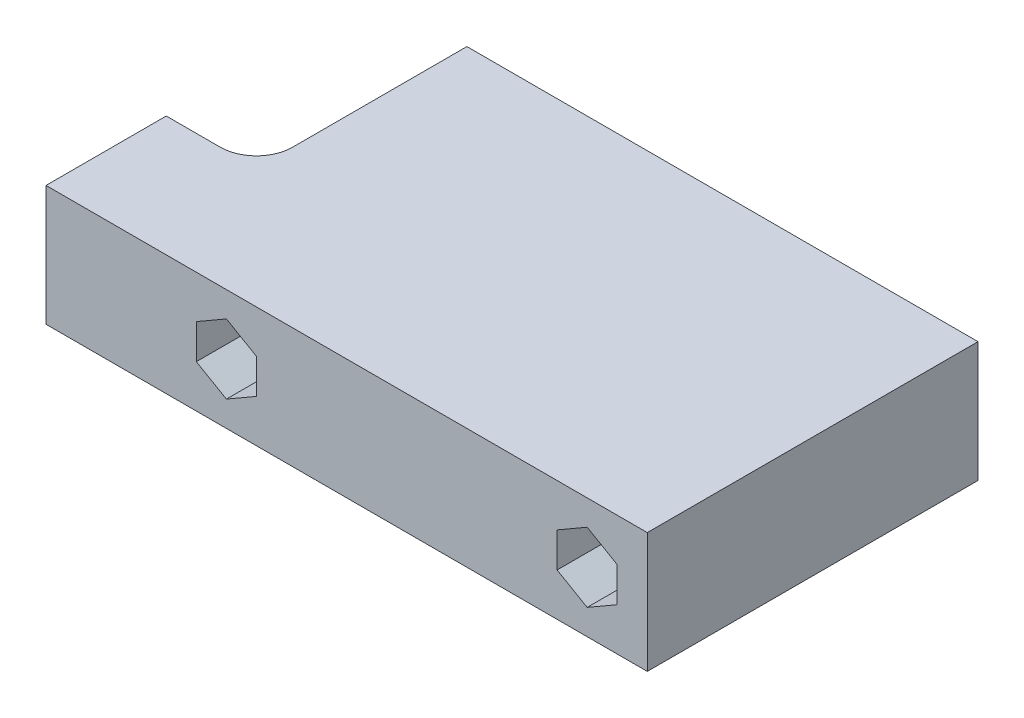
ISO-10303-21;
HEADER;
FILE_DESCRIPTION(('STEP AP214'),'2;1');
FILE_NAME('part.step','',(''),(''),'','','');
FILE_SCHEMA(('AUTOMOTIVE_DESIGN { 1 0 10303 214 1 1 1 1 }'));
ENDSEC;
DATA;
#1=APPLICATION_CONTEXT('core data for automotive mechanical design processes');
#2=APPLICATION_PROTOCOL_DEFINITION('international standard','automotive_design',2000,#1);
#3=PRODUCT_CONTEXT('',#1,'mechanical');
#4=PRODUCT('Part','Part','',(#3));
#5=PRODUCT_RELATED_PRODUCT_CATEGORY('part','',(#4));
#6=PRODUCT_DEFINITION_FORMATION('','',#4);
#7=PRODUCT_DEFINITION_CONTEXT('part definition',#1,'design');
#8=PRODUCT_DEFINITION('design','',#6,#7);
#9=PRODUCT_DEFINITION_SHAPE('','',#8);
#10=(LENGTH_UNIT() NAMED_UNIT(*) SI_UNIT(.MILLI.,.METRE.));
#11=(NAMED_UNIT(*) PLANE_ANGLE_UNIT() SI_UNIT($,.RADIAN.));
#12=(NAMED_UNIT(*) SI_UNIT($,.STERADIAN.) SOLID_ANGLE_UNIT());
#13=UNCERTAINTY_MEASURE_WITH_UNIT(LENGTH_MEASURE(1.E-05),#10,'distance_accuracy_value','');
#14=(GEOMETRIC_REPRESENTATION_CONTEXT(3) GLOBAL_UNCERTAINTY_ASSIGNED_CONTEXT((#13)) GLOBAL_UNIT_ASSIGNED_CONTEXT((#10,
#11,#12)) REPRESENTATION_CONTEXT('',''));
#15=CARTESIAN_POINT('',(0.,0.,0.));
#16=DIRECTION('',(0.,0.,1.));
#17=DIRECTION('',(1.,0.,0.));
#18=AXIS2_PLACEMENT_3D('',#15,#16,#17);
#19=CARTESIAN_POINT('',(-50.,0.,0.));
#20=DIRECTION('',(1.,0.,0.));
#21=DIRECTION('',(0.,0.,-1.));
#22=AXIS2_PLACEMENT_3D('',#19,#20,#21);
#23=PLANE('',#22);
#24=DIRECTION('',(0.,0.500000000000001,0.866025403784438));
#25=VECTOR('',#24,1.);
#26=CARTESIAN_POINT('',(-50.,2.40192378864668,-4.99999999999999));
#27=LINE('',#26,#25);
#28=CARTESIAN_POINT('',(-50.,2.40192378864668,-4.99999999999999));
#29=VERTEX_POINT('',#28);
#30=CARTESIAN_POINT('',(-50.,3.70096189432335,-2.74999999999999));
#31=VERTEX_POINT('',#30);
#32=EDGE_CURVE('E233',#29,#31,#27,.T.);
#33=ORIENTED_EDGE('',*,*,#32,.F.);
#34=DIRECTION('',(0.,-0.5,0.866025403784439));
#35=VECTOR('',#34,1.);
#36=CARTESIAN_POINT('',(-50.,3.70096189432334,-7.24999999999999));
#37=LINE('',#36,#35);
#38=CARTESIAN_POINT('',(-50.,3.70096189432334,-7.24999999999999));
#39=VERTEX_POINT('',#38);
#40=EDGE_CURVE('E47',#39,#29,#37,.T.);
#41=ORIENTED_EDGE('',*,*,#40,.F.);
#42=DIRECTION('',(0.,-1.,0.));
#43=VECTOR('',#42,1.);
#44=CARTESIAN_POINT('',(-50.,6.29903810567666,-7.24999999999999));
#45=LINE('',#44,#43);
#46=CARTESIAN_POINT('',(-50.,6.29903810567666,-7.24999999999999));
#47=VERTEX_POINT('',#46);
#48=EDGE_CURVE('E219',#47,#39,#45,.T.);
#49=ORIENTED_EDGE('',*,*,#48,.F.);
#50=DIRECTION('',(0.,-0.500000000000001,-0.866025403784438));
#51=VECTOR('',#50,1.);
#52=CARTESIAN_POINT('',(-50.,7.59807621135332,-4.99999999999999));
#53=LINE('',#52,#51);
#54=CARTESIAN_POINT('',(-50.,7.59807621135332,-4.99999999999999));
#55=VERTEX_POINT('',#54);
#56=EDGE_CURVE('E222',#55,#47,#53,.T.);
#57=ORIENTED_EDGE('',*,*,#56,.F.);
#58=DIRECTION('',(0.,0.5,-0.866025403784439));
#59=VECTOR('',#58,1.);
#60=CARTESIAN_POINT('',(-50.,6.29903810567666,-2.74999999999999));
#61=LINE('',#60,#59);
#62=CARTESIAN_POINT('',(-50.,6.29903810567666,-2.74999999999999));
#63=VERTEX_POINT('',#62);
#64=EDGE_CURVE('E238',#63,#55,#61,.T.);
#65=ORIENTED_EDGE('',*,*,#64,.F.);
#66=DIRECTION('',(0.,1.,0.));
#67=VECTOR('',#66,1.);
#68=CARTESIAN_POINT('',(-50.,3.70096189432335,-2.74999999999999));
#69=LINE('',#68,#67);
#70=EDGE_CURVE('E235',#31,#63,#69,.T.);
#71=ORIENTED_EDGE('',*,*,#70,.F.);
#72=EDGE_LOOP('',(#33,#41,#49,#57,#65,#71));
#73=FACE_BOUND('',#72,.T.);
#74=DIRECTION('',(0.,0.,-1.));
#75=VECTOR('',#74,1.);
#76=CARTESIAN_POINT('',(-50.,10.,0.));
#77=LINE('',#76,#75);
#78=CARTESIAN_POINT('',(-50.,10.,0.));
#79=VERTEX_POINT('',#78);
#80=CARTESIAN_POINT('',(-50.,10.,-9.99999999999999));
#81=VERTEX_POINT('',#80);
#82=EDGE_CURVE('E11',#79,#81,#77,.T.);
#83=ORIENTED_EDGE('',*,*,#82,.T.);
#84=DIRECTION('',(0.,1.,0.));
#85=VECTOR('',#84,1.);
#86=CARTESIAN_POINT('',(-50.,0.,-9.99999999999999));
#87=LINE('',#86,#85);
#88=CARTESIAN_POINT('',(-50.,0.,-9.99999999999999));
#89=VERTEX_POINT('',#88);
#90=EDGE_CURVE('E392',#89,#81,#87,.T.);
#91=ORIENTED_EDGE('',*,*,#90,.F.);
#92=DIRECTION('',(0.,0.,-1.));
#93=VECTOR('',#92,1.);
#94=CARTESIAN_POINT('',(-50.,0.,0.));
#95=LINE('',#94,#93);
#96=CARTESIAN_POINT('',(-50.,0.,0.));
#97=VERTEX_POINT('',#96);
#98=EDGE_CURVE('E394',#97,#89,#95,.T.);
#99=ORIENTED_EDGE('',*,*,#98,.F.);
#100=DIRECTION('',(0.,-1.,0.));
#101=VECTOR('',#100,1.);
#102=CARTESIAN_POINT('',(-50.,10.,0.));
#103=LINE('',#102,#101);
#104=EDGE_CURVE('E36',#79,#97,#103,.T.);
#105=ORIENTED_EDGE('',*,*,#104,.F.);
#106=EDGE_LOOP('',(#83,#91,#99,#105));
#107=FACE_BOUND('',#106,.T.);
#108=ADVANCED_FACE('F33',(#73,#107),#23,.F.);
#109=CARTESIAN_POINT('',(-2.5,6.44337567297407,-27.5));
#110=DIRECTION('',(0.500000000000001,0.866025403784438,0.));
#111=DIRECTION('',(-0.866025403784438,0.500000000000001,0.));
#112=AXIS2_PLACEMENT_3D('',#109,#110,#111);
#113=PLANE('',#112);
#114=DIRECTION('',(-0.866025403784438,0.500000000000001,0.));
#115=VECTOR('',#114,1.);
#116=CARTESIAN_POINT('',(-2.5,6.44337567297407,0.));
#117=LINE('',#116,#115);
#118=CARTESIAN_POINT('',(-2.5,6.44337567297407,0.));
#119=VERTEX_POINT('',#118);
#120=CARTESIAN_POINT('',(-5.,7.88675134594813,0.));
#121=VERTEX_POINT('',#120);
#122=EDGE_CURVE('E338',#119,#121,#117,.T.);
#123=ORIENTED_EDGE('',*,*,#122,.T.);
#124=DIRECTION('',(0.,0.,1.));
#125=VECTOR('',#124,1.);
#126=CARTESIAN_POINT('',(-5.,7.88675134594813,-27.5));
#127=LINE('',#126,#125);
#128=CARTESIAN_POINT('',(-5.,7.88675134594813,-27.5));
#129=VERTEX_POINT('',#128);
#130=EDGE_CURVE('E354',#129,#121,#127,.T.);
#131=ORIENTED_EDGE('',*,*,#130,.F.);
#132=DIRECTION('',(-0.866025403784438,0.500000000000001,0.));
#133=VECTOR('',#132,1.);
#134=CARTESIAN_POINT('',(-2.5,6.44337567297407,-27.5));
#135=LINE('',#134,#133);
#136=CARTESIAN_POINT('',(-2.5,6.44337567297406,-27.5));
#137=VERTEX_POINT('',#136);
#138=EDGE_CURVE('E321',#137,#129,#135,.T.);
#139=ORIENTED_EDGE('',*,*,#138,.F.);
#140=DIRECTION('',(0.,0.,1.));
#141=VECTOR('',#140,1.);
#142=CARTESIAN_POINT('',(-2.5,6.44337567297407,-27.5));
#143=LINE('',#142,#141);
#144=EDGE_CURVE('E356',#137,#119,#143,.T.);
#145=ORIENTED_EDGE('',*,*,#144,.T.);
#146=EDGE_LOOP('',(#123,#131,#139,#145));
#147=FACE_BOUND('',#146,.T.);
#148=ADVANCED_FACE('F434',(#147),#113,.F.);
#149=CARTESIAN_POINT('',(-5.,7.88675134594813,-27.5));
#150=DIRECTION('',(-0.5,0.866025403784439,0.));
#151=DIRECTION('',(-0.866025403784438,-0.5,0.));
#152=AXIS2_PLACEMENT_3D('',#149,#150,#151);
#153=PLANE('',#152);
#154=DIRECTION('',(-0.866025403784439,-0.5,0.));
#155=VECTOR('',#154,1.);
#156=CARTESIAN_POINT('',(-5.,7.88675134594813,0.));
#157=LINE('',#156,#155);
#158=CARTESIAN_POINT('',(-7.5,6.44337567297407,0.));
#159=VERTEX_POINT('',#158);
#160=EDGE_CURVE('E341',#121,#159,#157,.T.);
#161=ORIENTED_EDGE('',*,*,#160,.T.);
#162=DIRECTION('',(0.,0.,1.));
#163=VECTOR('',#162,1.);
#164=CARTESIAN_POINT('',(-7.5,6.44337567297407,-27.5));
#165=LINE('',#164,#163);
#166=CARTESIAN_POINT('',(-7.5,6.44337567297407,-27.5));
#167=VERTEX_POINT('',#166);
#168=EDGE_CURVE('E352',#167,#159,#165,.T.);
#169=ORIENTED_EDGE('',*,*,#168,.F.);
#170=DIRECTION('',(-0.866025403784439,-0.5,0.));
#171=VECTOR('',#170,1.);
#172=CARTESIAN_POINT('',(-5.,7.88675134594813,-27.5));
#173=LINE('',#172,#171);
#174=EDGE_CURVE('E324',#129,#167,#173,.T.);
#175=ORIENTED_EDGE('',*,*,#174,.F.);
#176=ORIENTED_EDGE('',*,*,#130,.T.);
#177=EDGE_LOOP('',(#161,#169,#175,#176));
#178=FACE_BOUND('',#177,.T.);
#179=ADVANCED_FACE('F441',(#178),#153,.F.);
#180=CARTESIAN_POINT('',(-7.5,6.44337567297407,-27.5));
#181=DIRECTION('',(-1.,0.,0.));
#182=DIRECTION('',(0.,-1.,0.));
#183=AXIS2_PLACEMENT_3D('',#180,#181,#182);
#184=PLANE('',#183);
#185=DIRECTION('',(0.,-1.,0.));
#186=VECTOR('',#185,1.);
#187=CARTESIAN_POINT('',(-7.5,6.44337567297407,0.));
#188=LINE('',#187,#186);
#189=CARTESIAN_POINT('',(-7.5,3.55662432702594,0.));
#190=VERTEX_POINT('',#189);
#191=EDGE_CURVE('E344',#159,#190,#188,.T.);
#192=ORIENTED_EDGE('',*,*,#191,.T.);
#193=DIRECTION('',(0.,0.,1.));
#194=VECTOR('',#193,1.);
#195=CARTESIAN_POINT('',(-7.5,3.55662432702594,-27.5));
#196=LINE('',#195,#194);
#197=CARTESIAN_POINT('',(-7.5,3.55662432702594,-27.5));
#198=VERTEX_POINT('',#197);
#199=EDGE_CURVE('E350',#198,#190,#196,.T.);
#200=ORIENTED_EDGE('',*,*,#199,.F.);
#201=DIRECTION('',(0.,-1.,0.));
#202=VECTOR('',#201,1.);
#203=CARTESIAN_POINT('',(-7.5,6.44337567297407,-27.5));
#204=LINE('',#203,#202);
#205=EDGE_CURVE('E327',#167,#198,#204,.T.);
#206=ORIENTED_EDGE('',*,*,#205,.F.);
#207=ORIENTED_EDGE('',*,*,#168,.T.);
#208=EDGE_LOOP('',(#192,#200,#206,#207));
#209=FACE_BOUND('',#208,.T.);
#210=ADVANCED_FACE('F483',(#209),#184,.F.);
#211=CARTESIAN_POINT('',(-7.5,3.55662432702594,-27.5));
#212=DIRECTION('',(-0.500000000000001,-0.866025403784438,0.));
#213=DIRECTION('',(0.866025403784438,-0.500000000000001,0.));
#214=AXIS2_PLACEMENT_3D('',#211,#212,#213);
#215=PLANE('',#214);
#216=DIRECTION('',(0.866025403784438,-0.500000000000001,0.));
#217=VECTOR('',#216,1.);
#218=CARTESIAN_POINT('',(-7.5,3.55662432702594,0.));
#219=LINE('',#218,#217);
#220=CARTESIAN_POINT('',(-5.,2.11324865405187,0.));
#221=VERTEX_POINT('',#220);
#222=EDGE_CURVE('E318',#190,#221,#219,.T.);
#223=ORIENTED_EDGE('',*,*,#222,.T.);
#224=DIRECTION('',(0.,0.,1.));
#225=VECTOR('',#224,1.);
#226=CARTESIAN_POINT('',(-5.,2.11324865405187,-27.5));
#227=LINE('',#226,#225);
#228=CARTESIAN_POINT('',(-5.,2.11324865405187,-27.5));
#229=VERTEX_POINT('',#228);
#230=EDGE_CURVE('E287',#229,#221,#227,.T.);
#231=ORIENTED_EDGE('',*,*,#230,.F.);
#232=DIRECTION('',(0.866025403784438,-0.500000000000001,0.));
#233=VECTOR('',#232,1.);
#234=CARTESIAN_POINT('',(-7.5,3.55662432702594,-27.5));
#235=LINE('',#234,#233);
#236=EDGE_CURVE('E330',#198,#229,#235,.T.);
#237=ORIENTED_EDGE('',*,*,#236,.F.);
#238=ORIENTED_EDGE('',*,*,#199,.T.);
#239=EDGE_LOOP('',(#223,#231,#237,#238));
#240=FACE_BOUND('',#239,.T.);
#241=ADVANCED_FACE('F479',(#240),#215,.F.);
#242=CARTESIAN_POINT('',(-5.,2.11324865405187,-27.5));
#243=DIRECTION('',(0.5,-0.866025403784439,0.));
#244=DIRECTION('',(0.866025403784439,0.5,0.));
#245=AXIS2_PLACEMENT_3D('',#242,#243,#244);
#246=PLANE('',#245);
#247=DIRECTION('',(0.866025403784439,0.5,0.));
#248=VECTOR('',#247,1.);
#249=CARTESIAN_POINT('',(-5.,2.11324865405187,0.));
#250=LINE('',#249,#248);
#251=CARTESIAN_POINT('',(-2.5,3.55662432702594,0.));
#252=VERTEX_POINT('',#251);
#253=EDGE_CURVE('E263',#221,#252,#250,.T.);
#254=ORIENTED_EDGE('',*,*,#253,.T.);
#255=DIRECTION('',(0.,0.,1.));
#256=VECTOR('',#255,1.);
#257=CARTESIAN_POINT('',(-2.5,3.55662432702594,-27.5));
#258=LINE('',#257,#256);
#259=CARTESIAN_POINT('',(-2.5,3.55662432702594,-27.5));
#260=VERTEX_POINT('',#259);
#261=EDGE_CURVE('E333',#260,#252,#258,.T.);
#262=ORIENTED_EDGE('',*,*,#261,.F.);
#263=DIRECTION('',(0.866025403784439,0.5,0.));
#264=VECTOR('',#263,1.);
#265=CARTESIAN_POINT('',(-5.,2.11324865405187,-27.5));
#266=LINE('',#265,#264);
#267=EDGE_CURVE('E314',#229,#260,#266,.T.);
#268=ORIENTED_EDGE('',*,*,#267,.F.);
#269=ORIENTED_EDGE('',*,*,#230,.T.);
#270=EDGE_LOOP('',(#254,#262,#268,#269));
#271=FACE_BOUND('',#270,.T.);
#272=ADVANCED_FACE('F482',(#271),#246,.F.);
#273=CARTESIAN_POINT('',(-2.5,3.55662432702594,-27.5));
#274=DIRECTION('',(1.,0.,0.));
#275=DIRECTION('',(0.,1.,0.));
#276=AXIS2_PLACEMENT_3D('',#273,#274,#275);
#277=PLANE('',#276);
#278=DIRECTION('',(0.,1.,0.));
#279=VECTOR('',#278,1.);
#280=CARTESIAN_POINT('',(-2.5,3.55662432702594,0.));
#281=LINE('',#280,#279);
#282=EDGE_CURVE('E335',#252,#119,#281,.T.);
#283=ORIENTED_EDGE('',*,*,#282,.T.);
#284=ORIENTED_EDGE('',*,*,#144,.F.);
#285=DIRECTION('',(0.,1.,0.));
#286=VECTOR('',#285,1.);
#287=CARTESIAN_POINT('',(-2.5,3.55662432702594,-27.5));
#288=LINE('',#287,#286);
#289=EDGE_CURVE('E317',#260,#137,#288,.T.);
#290=ORIENTED_EDGE('',*,*,#289,.F.);
#291=ORIENTED_EDGE('',*,*,#261,.T.);
#292=EDGE_LOOP('',(#283,#284,#290,#291));
#293=FACE_BOUND('',#292,.T.);
#294=ADVANCED_FACE('F470',(#293),#277,.F.);
#295=CARTESIAN_POINT('',(-32.5,6.44337567297407,-27.5));
#296=DIRECTION('',(0.500000000000001,0.866025403784438,0.));
#297=DIRECTION('',(-0.866025403784438,0.500000000000001,0.));
#298=AXIS2_PLACEMENT_3D('',#295,#296,#297);
#299=PLANE('',#298);
#300=DIRECTION('',(-0.866025403784438,0.500000000000001,0.));
#301=VECTOR('',#300,1.);
#302=CARTESIAN_POINT('',(-32.5,6.44337567297407,0.));
#303=LINE('',#302,#301);
#304=CARTESIAN_POINT('',(-32.5,6.44337567297407,0.));
#305=VERTEX_POINT('',#304);
#306=CARTESIAN_POINT('',(-35.,7.88675134594814,0.));
#307=VERTEX_POINT('',#306);
#308=EDGE_CURVE('E290',#305,#307,#303,.T.);
#309=ORIENTED_EDGE('',*,*,#308,.T.);
#310=DIRECTION('',(0.,0.,1.));
#311=VECTOR('',#310,1.);
#312=CARTESIAN_POINT('',(-35.,7.88675134594814,-27.5));
#313=LINE('',#312,#311);
#314=CARTESIAN_POINT('',(-35.,7.88675134594814,-27.5));
#315=VERTEX_POINT('',#314);
#316=EDGE_CURVE('E308',#315,#307,#313,.T.);
#317=ORIENTED_EDGE('',*,*,#316,.F.);
#318=DIRECTION('',(-0.866025403784438,0.500000000000001,0.));
#319=VECTOR('',#318,1.);
#320=CARTESIAN_POINT('',(-32.5,6.44337567297407,-27.5));
#321=LINE('',#320,#319);
#322=CARTESIAN_POINT('',(-32.5,6.44337567297407,-27.5));
#323=VERTEX_POINT('',#322);
#324=EDGE_CURVE('E271',#323,#315,#321,.T.);
#325=ORIENTED_EDGE('',*,*,#324,.F.);
#326=DIRECTION('',(0.,0.,1.));
#327=VECTOR('',#326,1.);
#328=CARTESIAN_POINT('',(-32.5,6.44337567297407,-27.5));
#329=LINE('',#328,#327);
#330=EDGE_CURVE('E310',#323,#305,#329,.T.);
#331=ORIENTED_EDGE('',*,*,#330,.T.);
#332=EDGE_LOOP('',(#309,#317,#325,#331));
#333=FACE_BOUND('',#332,.T.);
#334=ADVANCED_FACE('F466',(#333),#299,.F.);
#335=CARTESIAN_POINT('',(-35.,7.88675134594814,-27.5));
#336=DIRECTION('',(-0.5,0.866025403784439,0.));
#337=DIRECTION('',(-0.866025403784439,-0.5,0.));
#338=AXIS2_PLACEMENT_3D('',#335,#336,#337);
#339=PLANE('',#338);
#340=DIRECTION('',(-0.866025403784439,-0.5,0.));
#341=VECTOR('',#340,1.);
#342=CARTESIAN_POINT('',(-35.,7.88675134594814,0.));
#343=LINE('',#342,#341);
#344=CARTESIAN_POINT('',(-37.5,6.44337567297407,0.));
#345=VERTEX_POINT('',#344);
#346=EDGE_CURVE('E293',#307,#345,#343,.T.);
#347=ORIENTED_EDGE('',*,*,#346,.T.);
#348=DIRECTION('',(0.,0.,1.));
#349=VECTOR('',#348,1.);
#350=CARTESIAN_POINT('',(-37.5,6.44337567297407,-27.5));
#351=LINE('',#350,#349);
#352=CARTESIAN_POINT('',(-37.5,6.44337567297407,-27.5));
#353=VERTEX_POINT('',#352);
#354=EDGE_CURVE('E306',#353,#345,#351,.T.);
#355=ORIENTED_EDGE('',*,*,#354,.F.);
#356=DIRECTION('',(-0.866025403784439,-0.5,0.));
#357=VECTOR('',#356,1.);
#358=CARTESIAN_POINT('',(-35.,7.88675134594814,-27.5));
#359=LINE('',#358,#357);
#360=EDGE_CURVE('E274',#315,#353,#359,.T.);
#361=ORIENTED_EDGE('',*,*,#360,.F.);
#362=ORIENTED_EDGE('',*,*,#316,.T.);
#363=EDGE_LOOP('',(#347,#355,#361,#362));
#364=FACE_BOUND('',#363,.T.);
#365=ADVANCED_FACE('F462',(#364),#339,.F.);
#366=CARTESIAN_POINT('',(-37.5,6.44337567297407,-27.5));
#367=DIRECTION('',(-1.,0.,0.));
#368=DIRECTION('',(0.,0.,1.));
#369=AXIS2_PLACEMENT_3D('',#366,#367,#368);
#370=PLANE('',#369);
#371=DIRECTION('',(0.,-1.,0.));
#372=VECTOR('',#371,1.);
#373=CARTESIAN_POINT('',(-37.5,6.44337567297407,0.));
#374=LINE('',#373,#372);
#375=CARTESIAN_POINT('',(-37.5,3.55662432702594,0.));
#376=VERTEX_POINT('',#375);
#377=EDGE_CURVE('E296',#345,#376,#374,.T.);
#378=ORIENTED_EDGE('',*,*,#377,.T.);
#379=DIRECTION('',(0.,0.,1.));
#380=VECTOR('',#379,1.);
#381=CARTESIAN_POINT('',(-37.5,3.55662432702594,-27.5));
#382=LINE('',#381,#380);
#383=CARTESIAN_POINT('',(-37.5,3.55662432702594,-27.5));
#384=VERTEX_POINT('',#383);
#385=EDGE_CURVE('E304',#384,#376,#382,.T.);
#386=ORIENTED_EDGE('',*,*,#385,.F.);
#387=DIRECTION('',(0.,-1.,0.));
#388=VECTOR('',#387,1.);
#389=CARTESIAN_POINT('',(-37.5,6.44337567297407,-27.5));
#390=LINE('',#389,#388);
#391=EDGE_CURVE('E277',#353,#384,#390,.T.);
#392=ORIENTED_EDGE('',*,*,#391,.F.);
#393=ORIENTED_EDGE('',*,*,#354,.T.);
#394=EDGE_LOOP('',(#378,#386,#392,#393));
#395=FACE_BOUND('',#394,.T.);
#396=ADVANCED_FACE('F458',(#395),#370,.F.);
#397=CARTESIAN_POINT('',(-37.5,3.55662432702594,-27.5));
#398=DIRECTION('',(-0.5,-0.866025403784439,0.));
#399=DIRECTION('',(0.866025403784439,-0.5,0.));
#400=AXIS2_PLACEMENT_3D('',#397,#398,#399);
#401=PLANE('',#400);
#402=DIRECTION('',(0.866025403784439,-0.5,0.));
#403=VECTOR('',#402,1.);
#404=CARTESIAN_POINT('',(-37.5,3.55662432702594,0.));
#405=LINE('',#404,#403);
#406=CARTESIAN_POINT('',(-35.,2.11324865405187,0.));
#407=VERTEX_POINT('',#406);
#408=EDGE_CURVE('E268',#376,#407,#405,.T.);
#409=ORIENTED_EDGE('',*,*,#408,.T.);
#410=DIRECTION('',(0.,0.,1.));
#411=VECTOR('',#410,1.);
#412=CARTESIAN_POINT('',(-35.,2.11324865405187,-27.5));
#413=LINE('',#412,#411);
#414=CARTESIAN_POINT('',(-35.,2.11324865405187,-27.5));
#415=VERTEX_POINT('',#414);
#416=EDGE_CURVE('E301',#415,#407,#413,.T.);
#417=ORIENTED_EDGE('',*,*,#416,.F.);
#418=DIRECTION('',(0.866025403784439,-0.5,0.));
#419=VECTOR('',#418,1.);
#420=CARTESIAN_POINT('',(-37.5,3.55662432702594,-27.5));
#421=LINE('',#420,#419);
#422=EDGE_CURVE('E280',#384,#415,#421,.T.);
#423=ORIENTED_EDGE('',*,*,#422,.F.);
#424=ORIENTED_EDGE('',*,*,#385,.T.);
#425=EDGE_LOOP('',(#409,#417,#423,#424));
#426=FACE_BOUND('',#425,.T.);
#427=ADVANCED_FACE('F454',(#426),#401,.F.);
#428=CARTESIAN_POINT('',(-35.,2.11324865405187,-27.5));
#429=DIRECTION('',(0.5,-0.866025403784438,0.));
#430=DIRECTION('',(0.866025403784438,0.5,0.));
#431=AXIS2_PLACEMENT_3D('',#428,#429,#430);
#432=PLANE('',#431);
#433=DIRECTION('',(0.866025403784438,0.5,0.));
#434=VECTOR('',#433,1.);
#435=CARTESIAN_POINT('',(-35.,2.11324865405187,0.));
#436=LINE('',#435,#434);
#437=CARTESIAN_POINT('',(-32.5,3.55662432702593,0.));
#438=VERTEX_POINT('',#437);
#439=EDGE_CURVE('E284',#407,#438,#436,.T.);
#440=ORIENTED_EDGE('',*,*,#439,.T.);
#441=DIRECTION('',(0.,0.,1.));
#442=VECTOR('',#441,1.);
#443=CARTESIAN_POINT('',(-32.5,3.55662432702594,-27.5));
#444=LINE('',#443,#442);
#445=CARTESIAN_POINT('',(-32.5,3.55662432702594,-27.5));
#446=VERTEX_POINT('',#445);
#447=EDGE_CURVE('E283',#446,#438,#444,.T.);
#448=ORIENTED_EDGE('',*,*,#447,.F.);
#449=DIRECTION('',(0.866025403784438,0.5,0.));
#450=VECTOR('',#449,1.);
#451=CARTESIAN_POINT('',(-35.,2.11324865405187,-27.5));
#452=LINE('',#451,#450);
#453=EDGE_CURVE('E264',#415,#446,#452,.T.);
#454=ORIENTED_EDGE('',*,*,#453,.F.);
#455=ORIENTED_EDGE('',*,*,#416,.T.);
#456=EDGE_LOOP('',(#440,#448,#454,#455));
#457=FACE_BOUND('',#456,.T.);
#458=ADVANCED_FACE('F457',(#457),#432,.F.);
#459=CARTESIAN_POINT('',(-32.5,3.55662432702594,-27.5));
#460=DIRECTION('',(1.,0.,0.));
#461=DIRECTION('',(0.,0.,-1.));
#462=AXIS2_PLACEMENT_3D('',#459,#460,#461);
#463=PLANE('',#462);
#464=DIRECTION('',(0.,1.,0.));
#465=VECTOR('',#464,1.);
#466=CARTESIAN_POINT('',(-32.5,3.55662432702594,0.));
#467=LINE('',#466,#465);
#468=EDGE_CURVE('E286',#438,#305,#467,.T.);
#469=ORIENTED_EDGE('',*,*,#468,.T.);
#470=ORIENTED_EDGE('',*,*,#330,.F.);
#471=DIRECTION('',(0.,1.,0.));
#472=VECTOR('',#471,1.);
#473=CARTESIAN_POINT('',(-32.5,3.55662432702594,-27.5));
#474=LINE('',#473,#472);
#475=EDGE_CURVE('E267',#446,#323,#474,.T.);
#476=ORIENTED_EDGE('',*,*,#475,.F.);
#477=ORIENTED_EDGE('',*,*,#447,.T.);
#478=EDGE_LOOP('',(#469,#470,#476,#477));
#479=FACE_BOUND('',#478,.T.);
#480=ADVANCED_FACE('F472',(#479),#463,.F.);
#481=CARTESIAN_POINT('',(0.,10.,0.));
#482=DIRECTION('',(-1.,0.,0.));
#483=DIRECTION('',(0.,0.,1.));
#484=AXIS2_PLACEMENT_3D('',#481,#482,#483);
#485=PLANE('',#484);
#486=DIRECTION('',(0.,0.,-1.));
#487=VECTOR('',#486,1.);
#488=CARTESIAN_POINT('',(0.,0.,0.));
#489=LINE('',#488,#487);
#490=CARTESIAN_POINT('',(0.,0.,0.));
#491=VERTEX_POINT('',#490);
#492=CARTESIAN_POINT('',(0.,0.,-27.5));
#493=VERTEX_POINT('',#492);
#494=EDGE_CURVE('E303',#491,#493,#489,.T.);
#495=ORIENTED_EDGE('',*,*,#494,.T.);
#496=DIRECTION('',(0.,-1.,0.));
#497=VECTOR('',#496,1.);
#498=CARTESIAN_POINT('',(0.,10.,-27.5));
#499=LINE('',#498,#497);
#500=CARTESIAN_POINT('',(0.,10.,-27.5));
#501=VERTEX_POINT('',#500);
#502=EDGE_CURVE('E378',#501,#493,#499,.T.);
#503=ORIENTED_EDGE('',*,*,#502,.F.);
#504=DIRECTION('',(0.,0.,-1.));
#505=VECTOR('',#504,1.);
#506=CARTESIAN_POINT('',(0.,10.,0.));
#507=LINE('',#506,#505);
#508=CARTESIAN_POINT('',(0.,10.,0.));
#509=VERTEX_POINT('',#508);
#510=EDGE_CURVE('E360',#509,#501,#507,.T.);
#511=ORIENTED_EDGE('',*,*,#510,.F.);
#512=DIRECTION('',(0.,-1.,0.));
#513=VECTOR('',#512,1.);
#514=CARTESIAN_POINT('',(0.,10.,0.));
#515=LINE('',#514,#513);
#516=EDGE_CURVE('E369',#509,#491,#515,.T.);
#517=ORIENTED_EDGE('',*,*,#516,.T.);
#518=EDGE_LOOP('',(#495,#503,#511,#517));
#519=FACE_BOUND('',#518,.T.);
#520=ADVANCED_FACE('F407',(#519),#485,.F.);
#521=CARTESIAN_POINT('',(0.,10.,-27.5));
#522=DIRECTION('',(0.,0.,1.));
#523=DIRECTION('',(1.,0.,0.));
#524=AXIS2_PLACEMENT_3D('',#521,#522,#523);
#525=PLANE('',#524);
#526=ORIENTED_EDGE('',*,*,#422,.T.);
#527=ORIENTED_EDGE('',*,*,#453,.T.);
#528=ORIENTED_EDGE('',*,*,#475,.T.);
#529=ORIENTED_EDGE('',*,*,#324,.T.);
#530=ORIENTED_EDGE('',*,*,#360,.T.);
#531=ORIENTED_EDGE('',*,*,#391,.T.);
#532=EDGE_LOOP('',(#526,#527,#528,#529,#530,#531));
#533=FACE_BOUND('',#532,.T.);
#534=ORIENTED_EDGE('',*,*,#236,.T.);
#535=ORIENTED_EDGE('',*,*,#267,.T.);
#536=ORIENTED_EDGE('',*,*,#289,.T.);
#537=ORIENTED_EDGE('',*,*,#138,.T.);
#538=ORIENTED_EDGE('',*,*,#174,.T.);
#539=ORIENTED_EDGE('',*,*,#205,.T.);
#540=EDGE_LOOP('',(#534,#535,#536,#537,#538,#539));
#541=FACE_BOUND('',#540,.T.);
#542=DIRECTION('',(-1.,0.,0.));
#543=VECTOR('',#542,1.);
#544=CARTESIAN_POINT('',(0.,0.,-27.5));
#545=LINE('',#544,#543);
#546=CARTESIAN_POINT('',(-42.5,0.,-27.5));
#547=VERTEX_POINT('',#546);
#548=EDGE_CURVE('E372',#493,#547,#545,.T.);
#549=ORIENTED_EDGE('',*,*,#548,.T.);
#550=DIRECTION('',(0.,1.,0.));
#551=VECTOR('',#550,1.);
#552=CARTESIAN_POINT('',(-42.5,0.,-27.5));
#553=LINE('',#552,#551);
#554=CARTESIAN_POINT('',(-42.5,10.,-27.5));
#555=VERTEX_POINT('',#554);
#556=EDGE_CURVE('E256',#547,#555,#553,.T.);
#557=ORIENTED_EDGE('',*,*,#556,.T.);
#558=DIRECTION('',(-1.,0.,0.));
#559=VECTOR('',#558,1.);
#560=CARTESIAN_POINT('',(0.,10.,-27.5));
#561=LINE('',#560,#559);
#562=EDGE_CURVE('E363',#501,#555,#561,.T.);
#563=ORIENTED_EDGE('',*,*,#562,.F.);
#564=ORIENTED_EDGE('',*,*,#502,.T.);
#565=EDGE_LOOP('',(#549,#557,#563,#564));
#566=FACE_BOUND('',#565,.T.);
#567=ADVANCED_FACE('F497',(#533,#541,#566),#525,.F.);
#568=CARTESIAN_POINT('',(-42.5,0.,-27.5));
#569=DIRECTION('',(1.,0.,0.));
#570=DIRECTION('',(0.,0.,-1.));
#571=AXIS2_PLACEMENT_3D('',#568,#569,#570);
#572=PLANE('',#571);
#573=DIRECTION('',(0.,0.,-1.));
#574=VECTOR('',#573,1.);
#575=CARTESIAN_POINT('',(-42.5,0.,-27.5));
#576=LINE('',#575,#574);
#577=CARTESIAN_POINT('',(-42.5,0.,-13.));
#578=VERTEX_POINT('',#577);
#579=EDGE_CURVE('E254',#578,#547,#576,.T.);
#580=ORIENTED_EDGE('',*,*,#579,.F.);
#581=DIRECTION('',(0.,1.,0.));
#582=VECTOR('',#581,1.);
#583=CARTESIAN_POINT('',(-42.5,10.,-13.));
#584=LINE('',#583,#582);
#585=CARTESIAN_POINT('',(-42.5,10.,-13.));
#586=VERTEX_POINT('',#585);
#587=EDGE_CURVE('E384',#578,#586,#584,.T.);
#588=ORIENTED_EDGE('',*,*,#587,.T.);
#589=DIRECTION('',(0.,0.,-1.));
#590=VECTOR('',#589,1.);
#591=CARTESIAN_POINT('',(-42.5,10.,0.));
#592=LINE('',#591,#590);
#593=EDGE_CURVE('E261',#586,#555,#592,.T.);
#594=ORIENTED_EDGE('',*,*,#593,.T.);
#595=ORIENTED_EDGE('',*,*,#556,.F.);
#596=EDGE_LOOP('',(#580,#588,#594,#595));
#597=FACE_BOUND('',#596,.T.);
#598=ADVANCED_FACE('F422',(#597),#572,.F.);
#599=CARTESIAN_POINT('',(0.,10.,0.));
#600=DIRECTION('',(0.,0.,-1.));
#601=DIRECTION('',(-1.,0.,0.));
#602=AXIS2_PLACEMENT_3D('',#599,#600,#601);
#603=PLANE('',#602);
#604=ORIENTED_EDGE('',*,*,#468,.F.);
#605=ORIENTED_EDGE('',*,*,#439,.F.);
#606=ORIENTED_EDGE('',*,*,#408,.F.);
#607=ORIENTED_EDGE('',*,*,#377,.F.);
#608=ORIENTED_EDGE('',*,*,#346,.F.);
#609=ORIENTED_EDGE('',*,*,#308,.F.);
#610=EDGE_LOOP('',(#604,#605,#606,#607,#608,#609));
#611=FACE_BOUND('',#610,.T.);
#612=ORIENTED_EDGE('',*,*,#282,.F.);
#613=ORIENTED_EDGE('',*,*,#253,.F.);
#614=ORIENTED_EDGE('',*,*,#222,.F.);
#615=ORIENTED_EDGE('',*,*,#191,.F.);
#616=ORIENTED_EDGE('',*,*,#160,.F.);
#617=ORIENTED_EDGE('',*,*,#122,.F.);
#618=EDGE_LOOP('',(#612,#613,#614,#615,#616,#617));
#619=FACE_BOUND('',#618,.T.);
#620=DIRECTION('',(1.,0.,0.));
#621=VECTOR('',#620,1.);
#622=CARTESIAN_POINT('',(0.,10.,0.));
#623=LINE('',#622,#621);
#624=EDGE_CURVE('E367',#79,#509,#623,.T.);
#625=ORIENTED_EDGE('',*,*,#624,.F.);
#626=ORIENTED_EDGE('',*,*,#104,.T.);
#627=DIRECTION('',(1.,0.,0.));
#628=VECTOR('',#627,1.);
#629=CARTESIAN_POINT('',(0.,0.,0.));
#630=LINE('',#629,#628);
#631=EDGE_CURVE('E364',#97,#491,#630,.T.);
#632=ORIENTED_EDGE('',*,*,#631,.T.);
#633=ORIENTED_EDGE('',*,*,#516,.F.);
#634=EDGE_LOOP('',(#625,#626,#632,#633));
#635=FACE_BOUND('',#634,.T.);
#636=ADVANCED_FACE('F400',(#611,#619,#635),#603,.F.);
#637=CARTESIAN_POINT('',(-45.5,0.,-13.));
#638=DIRECTION('',(0.,-1.,0.));
#639=DIRECTION('',(0.,0.,-1.));
#640=AXIS2_PLACEMENT_3D('',#637,#638,#639);
#641=CYLINDRICAL_SURFACE('',#640,3.);
#642=CARTESIAN_POINT('',(-45.5,0.,-13.));
#643=DIRECTION('',(0.,1.,0.));
#644=DIRECTION('',(0.,0.,1.));
#645=AXIS2_PLACEMENT_3D('',#642,#643,#644);
#646=CIRCLE('',#645,3.);
#647=CARTESIAN_POINT('',(-45.5,0.,-9.99999999999999));
#648=VERTEX_POINT('',#647);
#649=EDGE_CURVE('E390',#648,#578,#646,.T.);
#650=ORIENTED_EDGE('',*,*,#649,.F.);
#651=DIRECTION('',(0.,1.,0.));
#652=VECTOR('',#651,1.);
#653=CARTESIAN_POINT('',(-45.5,0.,-9.99999999999999));
#654=LINE('',#653,#652);
#655=CARTESIAN_POINT('',(-45.5,10.,-9.99999999999999));
#656=VERTEX_POINT('',#655);
#657=EDGE_CURVE('E381',#656,#648,#654,.F.);
#658=ORIENTED_EDGE('',*,*,#657,.F.);
#659=CARTESIAN_POINT('',(-45.5,10.,-13.));
#660=DIRECTION('',(0.,1.,0.));
#661=DIRECTION('',(0.,0.,1.));
#662=AXIS2_PLACEMENT_3D('',#659,#660,#661);
#663=CIRCLE('',#662,3.);
#664=EDGE_CURVE('E387',#586,#656,#663,.F.);
#665=ORIENTED_EDGE('',*,*,#664,.F.);
#666=ORIENTED_EDGE('',*,*,#587,.F.);
#667=EDGE_LOOP('',(#650,#658,#665,#666));
#668=FACE_BOUND('',#667,.T.);
#669=ADVANCED_FACE('F423',(#668),#641,.F.);
#670=CARTESIAN_POINT('',(0.,10.,0.));
#671=DIRECTION('',(0.,1.,0.));
#672=DIRECTION('',(0.,0.,1.));
#673=AXIS2_PLACEMENT_3D('',#670,#671,#672);
#674=PLANE('',#673);
#675=ORIENTED_EDGE('',*,*,#82,.F.);
#676=ORIENTED_EDGE('',*,*,#624,.T.);
#677=ORIENTED_EDGE('',*,*,#510,.T.);
#678=ORIENTED_EDGE('',*,*,#562,.T.);
#679=ORIENTED_EDGE('',*,*,#593,.F.);
#680=ORIENTED_EDGE('',*,*,#664,.T.);
#681=DIRECTION('',(1.,0.,0.));
#682=VECTOR('',#681,1.);
#683=CARTESIAN_POINT('',(0.,10.,-9.99999999999999));
#684=LINE('',#683,#682);
#685=EDGE_CURVE('E259',#81,#656,#684,.T.);
#686=ORIENTED_EDGE('',*,*,#685,.F.);
#687=EDGE_LOOP('',(#675,#676,#677,#678,#679,#680,#686));
#688=FACE_BOUND('',#687,.T.);
#689=ADVANCED_FACE('F410',(#688),#674,.T.);
#690=CARTESIAN_POINT('',(0.,0.,0.));
#691=DIRECTION('',(0.,1.,0.));
#692=DIRECTION('',(0.,0.,1.));
#693=AXIS2_PLACEMENT_3D('',#690,#691,#692);
#694=PLANE('',#693);
#695=ORIENTED_EDGE('',*,*,#631,.F.);
#696=ORIENTED_EDGE('',*,*,#98,.T.);
#697=DIRECTION('',(1.,0.,0.));
#698=VECTOR('',#697,1.);
#699=CARTESIAN_POINT('',(-60.,0.,-9.99999999999999));
#700=LINE('',#699,#698);
#701=EDGE_CURVE('E245',#89,#648,#700,.T.);
#702=ORIENTED_EDGE('',*,*,#701,.T.);
#703=ORIENTED_EDGE('',*,*,#649,.T.);
#704=ORIENTED_EDGE('',*,*,#579,.T.);
#705=ORIENTED_EDGE('',*,*,#548,.F.);
#706=ORIENTED_EDGE('',*,*,#494,.F.);
#707=EDGE_LOOP('',(#695,#696,#702,#703,#704,#705,#706));
#708=FACE_BOUND('',#707,.T.);
#709=ADVANCED_FACE('F404',(#708),#694,.F.);
#710=CARTESIAN_POINT('',(-60.,0.,-9.99999999999999));
#711=DIRECTION('',(0.,0.,1.));
#712=DIRECTION('',(1.,0.,0.));
#713=AXIS2_PLACEMENT_3D('',#710,#711,#712);
#714=PLANE('',#713);
#715=ORIENTED_EDGE('',*,*,#701,.F.);
#716=ORIENTED_EDGE('',*,*,#90,.T.);
#717=ORIENTED_EDGE('',*,*,#685,.T.);
#718=ORIENTED_EDGE('',*,*,#657,.T.);
#719=EDGE_LOOP('',(#715,#716,#717,#718));
#720=FACE_BOUND('',#719,.T.);
#721=ADVANCED_FACE('F415',(#720),#714,.F.);
#722=CARTESIAN_POINT('',(-43.,3.70096189432334,-7.24999999999999));
#723=DIRECTION('',(0.,-0.866025403784439,-0.5));
#724=DIRECTION('',(0.,0.5,-0.866025403784439));
#725=AXIS2_PLACEMENT_3D('',#722,#723,#724);
#726=PLANE('',#725);
#727=ORIENTED_EDGE('',*,*,#40,.T.);
#728=DIRECTION('',(-1.,0.,0.));
#729=VECTOR('',#728,1.);
#730=CARTESIAN_POINT('',(-43.,2.40192378864668,-4.99999999999999));
#731=LINE('',#730,#729);
#732=CARTESIAN_POINT('',(-43.,2.40192378864668,-4.99999999999999));
#733=VERTEX_POINT('',#732);
#734=EDGE_CURVE('E196',#733,#29,#731,.T.);
#735=ORIENTED_EDGE('',*,*,#734,.F.);
#736=DIRECTION('',(0.,-0.5,0.866025403784439));
#737=VECTOR('',#736,1.);
#738=CARTESIAN_POINT('',(-43.,3.70096189432334,-7.24999999999999));
#739=LINE('',#738,#737);
#740=CARTESIAN_POINT('',(-43.,3.70096189432334,-7.24999999999999));
#741=VERTEX_POINT('',#740);
#742=EDGE_CURVE('E200',#741,#733,#739,.T.);
#743=ORIENTED_EDGE('',*,*,#742,.F.);
#744=DIRECTION('',(-1.,0.,0.));
#745=VECTOR('',#744,1.);
#746=CARTESIAN_POINT('',(-43.,3.70096189432334,-7.24999999999999));
#747=LINE('',#746,#745);
#748=EDGE_CURVE('E243',#741,#39,#747,.T.);
#749=ORIENTED_EDGE('',*,*,#748,.T.);
#750=EDGE_LOOP('',(#727,#735,#743,#749));
#751=FACE_BOUND('',#750,.T.);
#752=ADVANCED_FACE('F198',(#751),#726,.F.);
#753=CARTESIAN_POINT('',(-43.,6.29903810567666,-7.24999999999999));
#754=DIRECTION('',(0.,0.,-1.));
#755=DIRECTION('',(0.,1.,0.));
#756=AXIS2_PLACEMENT_3D('',#753,#754,#755);
#757=PLANE('',#756);
#758=ORIENTED_EDGE('',*,*,#48,.T.);
#759=ORIENTED_EDGE('',*,*,#748,.F.);
#760=DIRECTION('',(0.,-1.,0.));
#761=VECTOR('',#760,1.);
#762=CARTESIAN_POINT('',(-43.,6.29903810567666,-7.24999999999999));
#763=LINE('',#762,#761);
#764=CARTESIAN_POINT('',(-43.,6.29903810567666,-7.24999999999999));
#765=VERTEX_POINT('',#764);
#766=EDGE_CURVE('E206',#765,#741,#763,.T.);
#767=ORIENTED_EDGE('',*,*,#766,.F.);
#768=DIRECTION('',(-1.,0.,0.));
#769=VECTOR('',#768,1.);
#770=CARTESIAN_POINT('',(-43.,6.29903810567666,-7.24999999999999));
#771=LINE('',#770,#769);
#772=EDGE_CURVE('E246',#765,#47,#771,.T.);
#773=ORIENTED_EDGE('',*,*,#772,.T.);
#774=EDGE_LOOP('',(#758,#759,#767,#773));
#775=FACE_BOUND('',#774,.T.);
#776=ADVANCED_FACE('F449',(#775),#757,.F.);
#777=CARTESIAN_POINT('',(-43.,7.59807621135332,-4.99999999999999));
#778=DIRECTION('',(0.,0.866025403784438,-0.500000000000001));
#779=DIRECTION('',(0.,0.500000000000001,0.866025403784438));
#780=AXIS2_PLACEMENT_3D('',#777,#778,#779);
#781=PLANE('',#780);
#782=ORIENTED_EDGE('',*,*,#56,.T.);
#783=ORIENTED_EDGE('',*,*,#772,.F.);
#784=DIRECTION('',(0.,-0.500000000000001,-0.866025403784438));
#785=VECTOR('',#784,1.);
#786=CARTESIAN_POINT('',(-43.,7.59807621135332,-4.99999999999999));
#787=LINE('',#786,#785);
#788=CARTESIAN_POINT('',(-43.,7.59807621135332,-4.99999999999999));
#789=VERTEX_POINT('',#788);
#790=EDGE_CURVE('E229',#789,#765,#787,.T.);
#791=ORIENTED_EDGE('',*,*,#790,.F.);
#792=DIRECTION('',(-1.,0.,0.));
#793=VECTOR('',#792,1.);
#794=CARTESIAN_POINT('',(-43.,7.59807621135332,-4.99999999999999));
#795=LINE('',#794,#793);
#796=EDGE_CURVE('E248',#789,#55,#795,.T.);
#797=ORIENTED_EDGE('',*,*,#796,.T.);
#798=EDGE_LOOP('',(#782,#783,#791,#797));
#799=FACE_BOUND('',#798,.T.);
#800=ADVANCED_FACE('F555',(#799),#781,.F.);
#801=CARTESIAN_POINT('',(-43.,6.29903810567666,-2.74999999999999));
#802=DIRECTION('',(0.,0.866025403784439,0.5));
#803=DIRECTION('',(0.,-0.5,0.866025403784439));
#804=AXIS2_PLACEMENT_3D('',#801,#802,#803);
#805=PLANE('',#804);
#806=ORIENTED_EDGE('',*,*,#64,.T.);
#807=ORIENTED_EDGE('',*,*,#796,.F.);
#808=DIRECTION('',(0.,0.5,-0.866025403784439));
#809=VECTOR('',#808,1.);
#810=CARTESIAN_POINT('',(-43.,6.29903810567666,-2.74999999999999));
#811=LINE('',#810,#809);
#812=CARTESIAN_POINT('',(-43.,6.29903810567666,-2.74999999999999));
#813=VERTEX_POINT('',#812);
#814=EDGE_CURVE('E226',#813,#789,#811,.T.);
#815=ORIENTED_EDGE('',*,*,#814,.F.);
#816=DIRECTION('',(-1.,0.,0.));
#817=VECTOR('',#816,1.);
#818=CARTESIAN_POINT('',(-43.,6.29903810567666,-2.74999999999999));
#819=LINE('',#818,#817);
#820=EDGE_CURVE('E250',#813,#63,#819,.T.);
#821=ORIENTED_EDGE('',*,*,#820,.T.);
#822=EDGE_LOOP('',(#806,#807,#815,#821));
#823=FACE_BOUND('',#822,.T.);
#824=ADVANCED_FACE('F564',(#823),#805,.F.);
#825=CARTESIAN_POINT('',(-43.,3.70096189432335,-2.74999999999999));
#826=DIRECTION('',(0.,0.,1.));
#827=DIRECTION('',(0.,-1.,0.));
#828=AXIS2_PLACEMENT_3D('',#825,#826,#827);
#829=PLANE('',#828);
#830=ORIENTED_EDGE('',*,*,#70,.T.);
#831=ORIENTED_EDGE('',*,*,#820,.F.);
#832=DIRECTION('',(0.,1.,0.));
#833=VECTOR('',#832,1.);
#834=CARTESIAN_POINT('',(-43.,3.70096189432335,-2.74999999999999));
#835=LINE('',#834,#833);
#836=CARTESIAN_POINT('',(-43.,3.70096189432335,-2.74999999999999));
#837=VERTEX_POINT('',#836);
#838=EDGE_CURVE('E214',#837,#813,#835,.T.);
#839=ORIENTED_EDGE('',*,*,#838,.F.);
#840=DIRECTION('',(-1.,0.,0.));
#841=VECTOR('',#840,1.);
#842=CARTESIAN_POINT('',(-43.,3.70096189432335,-2.74999999999999));
#843=LINE('',#842,#841);
#844=EDGE_CURVE('E205',#837,#31,#843,.T.);
#845=ORIENTED_EDGE('',*,*,#844,.T.);
#846=EDGE_LOOP('',(#830,#831,#839,#845));
#847=FACE_BOUND('',#846,.T.);
#848=ADVANCED_FACE('F573',(#847),#829,.F.);
#849=CARTESIAN_POINT('',(-43.,2.40192378864668,-4.99999999999999));
#850=DIRECTION('',(0.,-0.866025403784438,0.500000000000001));
#851=DIRECTION('',(0.,-0.500000000000001,-0.866025403784438));
#852=AXIS2_PLACEMENT_3D('',#849,#850,#851);
#853=PLANE('',#852);
#854=ORIENTED_EDGE('',*,*,#32,.T.);
#855=ORIENTED_EDGE('',*,*,#844,.F.);
#856=DIRECTION('',(0.,0.500000000000001,0.866025403784438));
#857=VECTOR('',#856,1.);
#858=CARTESIAN_POINT('',(-43.,2.40192378864668,-4.99999999999999));
#859=LINE('',#858,#857);
#860=EDGE_CURVE('E209',#733,#837,#859,.T.);
#861=ORIENTED_EDGE('',*,*,#860,.F.);
#862=ORIENTED_EDGE('',*,*,#734,.T.);
#863=EDGE_LOOP('',(#854,#855,#861,#862));
#864=FACE_BOUND('',#863,.T.);
#865=ADVANCED_FACE('F210',(#864),#853,.F.);
#866=CARTESIAN_POINT('',(-43.,0.,0.));
#867=DIRECTION('',(-1.,0.,0.));
#868=DIRECTION('',(0.,0.,1.));
#869=AXIS2_PLACEMENT_3D('',#866,#867,#868);
#870=PLANE('',#869);
#871=ORIENTED_EDGE('',*,*,#742,.T.);
#872=ORIENTED_EDGE('',*,*,#860,.T.);
#873=ORIENTED_EDGE('',*,*,#838,.T.);
#874=ORIENTED_EDGE('',*,*,#814,.T.);
#875=ORIENTED_EDGE('',*,*,#790,.T.);
#876=ORIENTED_EDGE('',*,*,#766,.T.);
#877=EDGE_LOOP('',(#871,#872,#873,#874,#875,#876));
#878=FACE_BOUND('',#877,.T.);
#879=ADVANCED_FACE('F216',(#878),#870,.T.);
#880=CLOSED_SHELL('',(#108,#148,#179,#210,#241,#272,#294,#334,#365,#396,#427,#458,#480,#520,
#567,#598,#636,#669,#689,#709,#721,#752,#776,#800,#824,#848,#865,#879));
#881=MANIFOLD_SOLID_BREP('B2',#880);
#882=ADVANCED_BREP_SHAPE_REPRESENTATION('',(#18,#881),#14);
#883=SHAPE_DEFINITION_REPRESENTATION(#9,#882);
ENDSEC;
END-ISO-10303-21;
